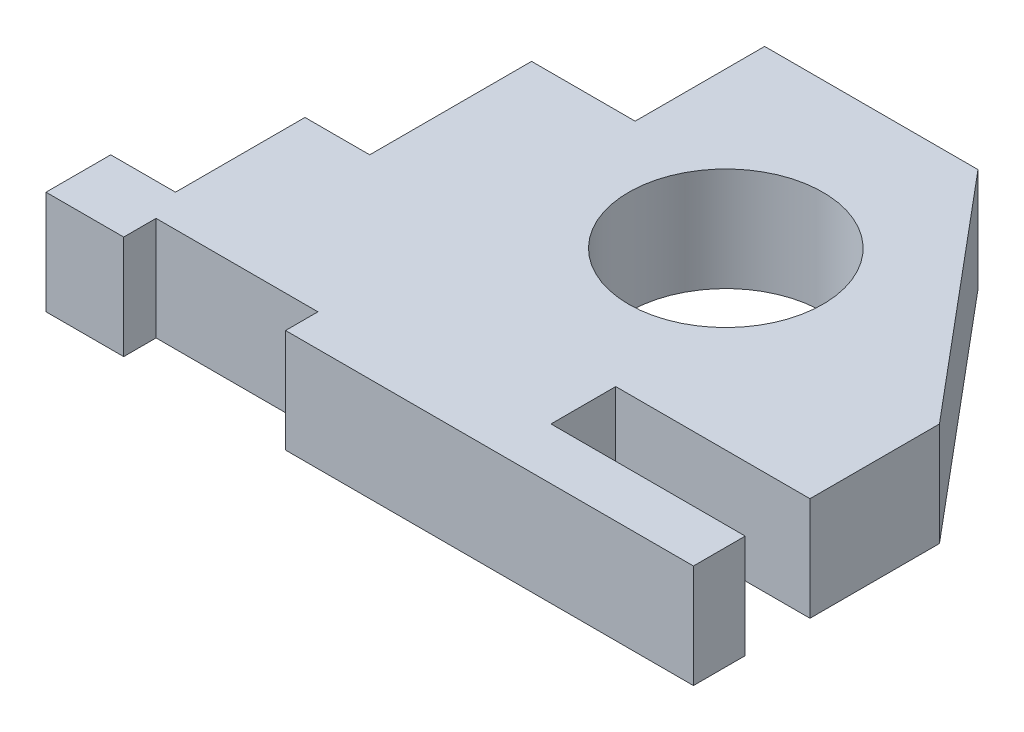
ISO-10303-21;
HEADER;
FILE_DESCRIPTION(('STEP AP214'),'2;1');
FILE_NAME('part.step','',(''),(''),'','','');
FILE_SCHEMA(('AUTOMOTIVE_DESIGN { 1 0 10303 214 1 1 1 1 }'));
ENDSEC;
DATA;
#1=APPLICATION_CONTEXT('core data for automotive mechanical design processes');
#2=APPLICATION_PROTOCOL_DEFINITION('international standard','automotive_design',2000,#1);
#3=PRODUCT_CONTEXT('',#1,'mechanical');
#4=PRODUCT('Part','Part','',(#3));
#5=PRODUCT_RELATED_PRODUCT_CATEGORY('part','',(#4));
#6=PRODUCT_DEFINITION_FORMATION('','',#4);
#7=PRODUCT_DEFINITION_CONTEXT('part definition',#1,'design');
#8=PRODUCT_DEFINITION('design','',#6,#7);
#9=PRODUCT_DEFINITION_SHAPE('','',#8);
#10=(LENGTH_UNIT() NAMED_UNIT(*) SI_UNIT(.MILLI.,.METRE.));
#11=(NAMED_UNIT(*) PLANE_ANGLE_UNIT() SI_UNIT($,.RADIAN.));
#12=(NAMED_UNIT(*) SI_UNIT($,.STERADIAN.) SOLID_ANGLE_UNIT());
#13=UNCERTAINTY_MEASURE_WITH_UNIT(LENGTH_MEASURE(1.E-05),#10,'distance_accuracy_value','');
#14=(GEOMETRIC_REPRESENTATION_CONTEXT(3) GLOBAL_UNCERTAINTY_ASSIGNED_CONTEXT((#13)) GLOBAL_UNIT_ASSIGNED_CONTEXT((#10,
#11,#12)) REPRESENTATION_CONTEXT('',''));
#15=CARTESIAN_POINT('',(0.,0.,0.));
#16=DIRECTION('',(0.,0.,1.));
#17=DIRECTION('',(1.,0.,0.));
#18=AXIS2_PLACEMENT_3D('',#15,#16,#17);
#19=CARTESIAN_POINT('',(0.,16.,0.));
#20=DIRECTION('',(0.,-1.,0.));
#21=DIRECTION('',(0.,0.,-1.));
#22=AXIS2_PLACEMENT_3D('',#19,#20,#21);
#23=PLANE('',#22);
#24=DIRECTION('',(0.,0.,1.));
#25=VECTOR('',#24,1.);
#26=CARTESIAN_POINT('',(0.,16.,0.));
#27=LINE('',#26,#25);
#28=CARTESIAN_POINT('',(0.,16.,-10.));
#29=VERTEX_POINT('',#28);
#30=CARTESIAN_POINT('',(0.,16.,0.));
#31=VERTEX_POINT('',#30);
#32=EDGE_CURVE('E233',#29,#31,#27,.T.);
#33=ORIENTED_EDGE('',*,*,#32,.T.);
#34=DIRECTION('',(1.,0.,0.));
#35=VECTOR('',#34,1.);
#36=CARTESIAN_POINT('',(0.,16.,0.));
#37=LINE('',#36,#35);
#38=CARTESIAN_POINT('',(12.,16.,0.));
#39=VERTEX_POINT('',#38);
#40=EDGE_CURVE('E126',#31,#39,#37,.T.);
#41=ORIENTED_EDGE('',*,*,#40,.T.);
#42=DIRECTION('',(0.,0.,-1.));
#43=VECTOR('',#42,1.);
#44=CARTESIAN_POINT('',(12.,16.,0.));
#45=LINE('',#44,#43);
#46=CARTESIAN_POINT('',(12.,16.,-5.));
#47=VERTEX_POINT('',#46);
#48=EDGE_CURVE('E281',#39,#47,#45,.T.);
#49=ORIENTED_EDGE('',*,*,#48,.T.);
#50=DIRECTION('',(1.,0.,0.));
#51=VECTOR('',#50,1.);
#52=CARTESIAN_POINT('',(12.,16.,-5.));
#53=LINE('',#52,#51);
#54=CARTESIAN_POINT('',(37.,16.,-5.));
#55=VERTEX_POINT('',#54);
#56=EDGE_CURVE('E300',#47,#55,#53,.T.);
#57=ORIENTED_EDGE('',*,*,#56,.T.);
#58=DIRECTION('',(0.,0.,1.));
#59=VECTOR('',#58,1.);
#60=CARTESIAN_POINT('',(37.,16.,-5.));
#61=LINE('',#60,#59);
#62=CARTESIAN_POINT('',(37.,16.,0.));
#63=VERTEX_POINT('',#62);
#64=EDGE_CURVE('E297',#55,#63,#61,.T.);
#65=ORIENTED_EDGE('',*,*,#64,.T.);
#66=DIRECTION('',(1.,0.,0.));
#67=VECTOR('',#66,1.);
#68=CARTESIAN_POINT('',(37.,16.,0.));
#69=LINE('',#68,#67);
#70=CARTESIAN_POINT('',(100.,16.,0.));
#71=VERTEX_POINT('',#70);
#72=EDGE_CURVE('E299',#63,#71,#69,.T.);
#73=ORIENTED_EDGE('',*,*,#72,.T.);
#74=DIRECTION('',(0.,0.,-1.));
#75=VECTOR('',#74,1.);
#76=CARTESIAN_POINT('',(100.,16.,0.));
#77=LINE('',#76,#75);
#78=CARTESIAN_POINT('',(100.,16.,-8.));
#79=VERTEX_POINT('',#78);
#80=EDGE_CURVE('E302',#71,#79,#77,.T.);
#81=ORIENTED_EDGE('',*,*,#80,.T.);
#82=DIRECTION('',(-1.,0.,0.));
#83=VECTOR('',#82,1.);
#84=CARTESIAN_POINT('',(100.,16.,-8.));
#85=LINE('',#84,#83);
#86=CARTESIAN_POINT('',(70.,16.,-8.));
#87=VERTEX_POINT('',#86);
#88=EDGE_CURVE('E308',#79,#87,#85,.T.);
#89=ORIENTED_EDGE('',*,*,#88,.T.);
#90=DIRECTION('',(0.,0.,-1.));
#91=VECTOR('',#90,1.);
#92=CARTESIAN_POINT('',(70.,16.,-8.));
#93=LINE('',#92,#91);
#94=CARTESIAN_POINT('',(70.,16.,-18.));
#95=VERTEX_POINT('',#94);
#96=EDGE_CURVE('E310',#87,#95,#93,.T.);
#97=ORIENTED_EDGE('',*,*,#96,.T.);
#98=DIRECTION('',(1.,0.,0.));
#99=VECTOR('',#98,1.);
#100=CARTESIAN_POINT('',(70.,16.,-18.));
#101=LINE('',#100,#99);
#102=CARTESIAN_POINT('',(100.,16.,-18.));
#103=VERTEX_POINT('',#102);
#104=EDGE_CURVE('E312',#95,#103,#101,.T.);
#105=ORIENTED_EDGE('',*,*,#104,.T.);
#106=DIRECTION('',(0.,0.,-1.));
#107=VECTOR('',#106,1.);
#108=CARTESIAN_POINT('',(100.,16.,-18.));
#109=LINE('',#108,#107);
#110=CARTESIAN_POINT('',(100.,16.,-38.));
#111=VERTEX_POINT('',#110);
#112=EDGE_CURVE('E314',#103,#111,#109,.T.);
#113=ORIENTED_EDGE('',*,*,#112,.T.);
#114=DIRECTION('',(-0.642787609686541,0.,-0.766044443118977));
#115=VECTOR('',#114,1.);
#116=CARTESIAN_POINT('',(100.,16.,-38.));
#117=LINE('',#116,#115);
#118=CARTESIAN_POINT('',(68.9533136464405,16.,-75.));
#119=VERTEX_POINT('',#118);
#120=EDGE_CURVE('E316',#111,#119,#117,.T.);
#121=ORIENTED_EDGE('',*,*,#120,.T.);
#122=DIRECTION('',(-1.,0.,0.));
#123=VECTOR('',#122,1.);
#124=CARTESIAN_POINT('',(68.9533136464405,16.,-75.));
#125=LINE('',#124,#123);
#126=CARTESIAN_POINT('',(36.,16.,-75.));
#127=VERTEX_POINT('',#126);
#128=EDGE_CURVE('E318',#119,#127,#125,.T.);
#129=ORIENTED_EDGE('',*,*,#128,.T.);
#130=DIRECTION('',(0.,0.,1.));
#131=VECTOR('',#130,1.);
#132=CARTESIAN_POINT('',(36.,16.,-75.));
#133=LINE('',#132,#131);
#134=CARTESIAN_POINT('',(36.,16.,-55.));
#135=VERTEX_POINT('',#134);
#136=EDGE_CURVE('E320',#127,#135,#133,.T.);
#137=ORIENTED_EDGE('',*,*,#136,.T.);
#138=DIRECTION('',(-1.,0.,0.));
#139=VECTOR('',#138,1.);
#140=CARTESIAN_POINT('',(36.,16.,-55.));
#141=LINE('',#140,#139);
#142=CARTESIAN_POINT('',(20.,16.,-55.));
#143=VERTEX_POINT('',#142);
#144=EDGE_CURVE('E322',#135,#143,#141,.T.);
#145=ORIENTED_EDGE('',*,*,#144,.T.);
#146=DIRECTION('',(0.,0.,1.));
#147=VECTOR('',#146,1.);
#148=CARTESIAN_POINT('',(20.,16.,-30.));
#149=LINE('',#148,#147);
#150=CARTESIAN_POINT('',(20.,16.,-30.));
#151=VERTEX_POINT('',#150);
#152=EDGE_CURVE('E178',#143,#151,#149,.T.);
#153=ORIENTED_EDGE('',*,*,#152,.T.);
#154=DIRECTION('',(-1.,0.,0.));
#155=VECTOR('',#154,1.);
#156=CARTESIAN_POINT('',(10.,16.,-30.));
#157=LINE('',#156,#155);
#158=CARTESIAN_POINT('',(10.,16.,-30.));
#159=VERTEX_POINT('',#158);
#160=EDGE_CURVE('E172',#151,#159,#157,.T.);
#161=ORIENTED_EDGE('',*,*,#160,.T.);
#162=DIRECTION('',(0.,0.,1.));
#163=VECTOR('',#162,1.);
#164=CARTESIAN_POINT('',(10.,16.,-10.));
#165=LINE('',#164,#163);
#166=CARTESIAN_POINT('',(10.,16.,-10.));
#167=VERTEX_POINT('',#166);
#168=EDGE_CURVE('E176',#159,#167,#165,.T.);
#169=ORIENTED_EDGE('',*,*,#168,.T.);
#170=DIRECTION('',(-1.,0.,0.));
#171=VECTOR('',#170,1.);
#172=CARTESIAN_POINT('',(0.,16.,-10.));
#173=LINE('',#172,#171);
#174=EDGE_CURVE('E50',#167,#29,#173,.T.);
#175=ORIENTED_EDGE('',*,*,#174,.T.);
#176=EDGE_LOOP('',(#33,#41,#49,#57,#65,#73,#81,#89,#97,#105,#113,#121,#129,#137,#145,#153,#161,
#169,#175));
#177=FACE_BOUND('',#176,.T.);
#178=CARTESIAN_POINT('',(60.,16.,-45.));
#179=DIRECTION('',(0.,1.,0.));
#180=DIRECTION('',(0.,0.,1.));
#181=AXIS2_PLACEMENT_3D('',#178,#179,#180);
#182=CIRCLE('',#181,15.);
#183=CARTESIAN_POINT('',(60.,16.,-30.));
#184=VERTEX_POINT('',#183);
#185=EDGE_CURVE('E200',#184,#184,#182,.T.);
#186=ORIENTED_EDGE('',*,*,#185,.F.);
#187=EDGE_LOOP('',(#186));
#188=FACE_BOUND('',#187,.T.);
#189=ADVANCED_FACE('F33',(#177,#188),#23,.F.);
#190=CARTESIAN_POINT('',(0.,0.,0.));
#191=DIRECTION('',(0.,-1.,0.));
#192=DIRECTION('',(0.,0.,-1.));
#193=AXIS2_PLACEMENT_3D('',#190,#191,#192);
#194=PLANE('',#193);
#195=DIRECTION('',(0.,0.,1.));
#196=VECTOR('',#195,1.);
#197=CARTESIAN_POINT('',(0.,0.,0.));
#198=LINE('',#197,#196);
#199=CARTESIAN_POINT('',(0.,0.,-10.));
#200=VERTEX_POINT('',#199);
#201=CARTESIAN_POINT('',(0.,0.,0.));
#202=VERTEX_POINT('',#201);
#203=EDGE_CURVE('E196',#200,#202,#198,.T.);
#204=ORIENTED_EDGE('',*,*,#203,.F.);
#205=DIRECTION('',(-1.,0.,0.));
#206=VECTOR('',#205,1.);
#207=CARTESIAN_POINT('',(0.,0.,-10.));
#208=LINE('',#207,#206);
#209=CARTESIAN_POINT('',(10.,0.,-10.));
#210=VERTEX_POINT('',#209);
#211=EDGE_CURVE('E118',#210,#200,#208,.T.);
#212=ORIENTED_EDGE('',*,*,#211,.F.);
#213=DIRECTION('',(0.,0.,1.));
#214=VECTOR('',#213,1.);
#215=CARTESIAN_POINT('',(10.,0.,-10.));
#216=LINE('',#215,#214);
#217=CARTESIAN_POINT('',(10.,0.,-30.));
#218=VERTEX_POINT('',#217);
#219=EDGE_CURVE('E112',#218,#210,#216,.T.);
#220=ORIENTED_EDGE('',*,*,#219,.F.);
#221=DIRECTION('',(-1.,0.,0.));
#222=VECTOR('',#221,1.);
#223=CARTESIAN_POINT('',(10.,0.,-30.));
#224=LINE('',#223,#222);
#225=CARTESIAN_POINT('',(20.,0.,-30.));
#226=VERTEX_POINT('',#225);
#227=EDGE_CURVE('E186',#226,#218,#224,.T.);
#228=ORIENTED_EDGE('',*,*,#227,.F.);
#229=DIRECTION('',(0.,0.,1.));
#230=VECTOR('',#229,1.);
#231=CARTESIAN_POINT('',(20.,0.,-30.));
#232=LINE('',#231,#230);
#233=CARTESIAN_POINT('',(20.,0.,-55.));
#234=VERTEX_POINT('',#233);
#235=EDGE_CURVE('E228',#234,#226,#232,.T.);
#236=ORIENTED_EDGE('',*,*,#235,.F.);
#237=DIRECTION('',(-1.,0.,0.));
#238=VECTOR('',#237,1.);
#239=CARTESIAN_POINT('',(36.,0.,-55.));
#240=LINE('',#239,#238);
#241=CARTESIAN_POINT('',(36.,0.,-55.));
#242=VERTEX_POINT('',#241);
#243=EDGE_CURVE('E226',#242,#234,#240,.T.);
#244=ORIENTED_EDGE('',*,*,#243,.F.);
#245=DIRECTION('',(0.,0.,1.));
#246=VECTOR('',#245,1.);
#247=CARTESIAN_POINT('',(36.,0.,-75.));
#248=LINE('',#247,#246);
#249=CARTESIAN_POINT('',(36.,0.,-75.));
#250=VERTEX_POINT('',#249);
#251=EDGE_CURVE('E224',#250,#242,#248,.T.);
#252=ORIENTED_EDGE('',*,*,#251,.F.);
#253=DIRECTION('',(-1.,0.,0.));
#254=VECTOR('',#253,1.);
#255=CARTESIAN_POINT('',(68.9533136464405,0.,-75.));
#256=LINE('',#255,#254);
#257=CARTESIAN_POINT('',(68.9533136464405,0.,-75.));
#258=VERTEX_POINT('',#257);
#259=EDGE_CURVE('E222',#258,#250,#256,.T.);
#260=ORIENTED_EDGE('',*,*,#259,.F.);
#261=DIRECTION('',(-0.642787609686541,0.,-0.766044443118977));
#262=VECTOR('',#261,1.);
#263=CARTESIAN_POINT('',(100.,0.,-38.));
#264=LINE('',#263,#262);
#265=CARTESIAN_POINT('',(100.,0.,-38.));
#266=VERTEX_POINT('',#265);
#267=EDGE_CURVE('E220',#266,#258,#264,.T.);
#268=ORIENTED_EDGE('',*,*,#267,.F.);
#269=DIRECTION('',(0.,0.,-1.));
#270=VECTOR('',#269,1.);
#271=CARTESIAN_POINT('',(100.,0.,-18.));
#272=LINE('',#271,#270);
#273=CARTESIAN_POINT('',(100.,0.,-18.));
#274=VERTEX_POINT('',#273);
#275=EDGE_CURVE('E218',#274,#266,#272,.T.);
#276=ORIENTED_EDGE('',*,*,#275,.F.);
#277=DIRECTION('',(1.,0.,0.));
#278=VECTOR('',#277,1.);
#279=CARTESIAN_POINT('',(70.,0.,-18.));
#280=LINE('',#279,#278);
#281=CARTESIAN_POINT('',(70.,0.,-18.));
#282=VERTEX_POINT('',#281);
#283=EDGE_CURVE('E216',#282,#274,#280,.T.);
#284=ORIENTED_EDGE('',*,*,#283,.F.);
#285=DIRECTION('',(0.,0.,-1.));
#286=VECTOR('',#285,1.);
#287=CARTESIAN_POINT('',(70.,0.,-8.));
#288=LINE('',#287,#286);
#289=CARTESIAN_POINT('',(70.,0.,-8.));
#290=VERTEX_POINT('',#289);
#291=EDGE_CURVE('E214',#290,#282,#288,.T.);
#292=ORIENTED_EDGE('',*,*,#291,.F.);
#293=DIRECTION('',(-1.,0.,0.));
#294=VECTOR('',#293,1.);
#295=CARTESIAN_POINT('',(100.,0.,-8.));
#296=LINE('',#295,#294);
#297=CARTESIAN_POINT('',(100.,0.,-8.));
#298=VERTEX_POINT('',#297);
#299=EDGE_CURVE('E212',#298,#290,#296,.T.);
#300=ORIENTED_EDGE('',*,*,#299,.F.);
#301=DIRECTION('',(0.,0.,-1.));
#302=VECTOR('',#301,1.);
#303=CARTESIAN_POINT('',(100.,0.,0.));
#304=LINE('',#303,#302);
#305=CARTESIAN_POINT('',(100.,0.,0.));
#306=VERTEX_POINT('',#305);
#307=EDGE_CURVE('E210',#306,#298,#304,.T.);
#308=ORIENTED_EDGE('',*,*,#307,.F.);
#309=DIRECTION('',(1.,0.,0.));
#310=VECTOR('',#309,1.);
#311=CARTESIAN_POINT('',(37.,0.,0.));
#312=LINE('',#311,#310);
#313=CARTESIAN_POINT('',(37.,0.,0.));
#314=VERTEX_POINT('',#313);
#315=EDGE_CURVE('E208',#314,#306,#312,.T.);
#316=ORIENTED_EDGE('',*,*,#315,.F.);
#317=DIRECTION('',(0.,0.,1.));
#318=VECTOR('',#317,1.);
#319=CARTESIAN_POINT('',(37.,0.,-5.));
#320=LINE('',#319,#318);
#321=CARTESIAN_POINT('',(37.,0.,-5.));
#322=VERTEX_POINT('',#321);
#323=EDGE_CURVE('E206',#322,#314,#320,.T.);
#324=ORIENTED_EDGE('',*,*,#323,.F.);
#325=DIRECTION('',(1.,0.,0.));
#326=VECTOR('',#325,1.);
#327=CARTESIAN_POINT('',(12.,0.,-5.));
#328=LINE('',#327,#326);
#329=CARTESIAN_POINT('',(12.,0.,-5.));
#330=VERTEX_POINT('',#329);
#331=EDGE_CURVE('E204',#330,#322,#328,.T.);
#332=ORIENTED_EDGE('',*,*,#331,.F.);
#333=DIRECTION('',(0.,0.,-1.));
#334=VECTOR('',#333,1.);
#335=CARTESIAN_POINT('',(12.,0.,0.));
#336=LINE('',#335,#334);
#337=CARTESIAN_POINT('',(12.,0.,0.));
#338=VERTEX_POINT('',#337);
#339=EDGE_CURVE('E202',#338,#330,#336,.T.);
#340=ORIENTED_EDGE('',*,*,#339,.F.);
#341=DIRECTION('',(1.,0.,0.));
#342=VECTOR('',#341,1.);
#343=CARTESIAN_POINT('',(0.,0.,0.));
#344=LINE('',#343,#342);
#345=EDGE_CURVE('E199',#202,#338,#344,.T.);
#346=ORIENTED_EDGE('',*,*,#345,.F.);
#347=EDGE_LOOP('',(#204,#212,#220,#228,#236,#244,#252,#260,#268,#276,#284,#292,#300,#308,#316,
#324,#332,#340,#346));
#348=FACE_BOUND('',#347,.T.);
#349=CARTESIAN_POINT('',(60.,0.,-45.));
#350=DIRECTION('',(0.,1.,0.));
#351=DIRECTION('',(0.,0.,1.));
#352=AXIS2_PLACEMENT_3D('',#349,#350,#351);
#353=CIRCLE('',#352,15.);
#354=CARTESIAN_POINT('',(60.,0.,-30.));
#355=VERTEX_POINT('',#354);
#356=EDGE_CURVE('E560',#355,#355,#353,.T.);
#357=ORIENTED_EDGE('',*,*,#356,.T.);
#358=EDGE_LOOP('',(#357));
#359=FACE_BOUND('',#358,.T.);
#360=ADVANCED_FACE('F285',(#348,#359),#194,.T.);
#361=CARTESIAN_POINT('',(0.,16.,0.));
#362=DIRECTION('',(1.,0.,0.));
#363=DIRECTION('',(0.,0.,-1.));
#364=AXIS2_PLACEMENT_3D('',#361,#362,#363);
#365=PLANE('',#364);
#366=ORIENTED_EDGE('',*,*,#203,.T.);
#367=DIRECTION('',(0.,-1.,0.));
#368=VECTOR('',#367,1.);
#369=CARTESIAN_POINT('',(0.,16.,0.));
#370=LINE('',#369,#368);
#371=EDGE_CURVE('E11',#31,#202,#370,.T.);
#372=ORIENTED_EDGE('',*,*,#371,.F.);
#373=ORIENTED_EDGE('',*,*,#32,.F.);
#374=DIRECTION('',(0.,-1.,0.));
#375=VECTOR('',#374,1.);
#376=CARTESIAN_POINT('',(0.,16.,-10.));
#377=LINE('',#376,#375);
#378=EDGE_CURVE('E192',#29,#200,#377,.T.);
#379=ORIENTED_EDGE('',*,*,#378,.T.);
#380=EDGE_LOOP('',(#366,#372,#373,#379));
#381=FACE_BOUND('',#380,.T.);
#382=ADVANCED_FACE('F35',(#381),#365,.F.);
#383=CARTESIAN_POINT('',(0.,16.,0.));
#384=DIRECTION('',(0.,0.,-1.));
#385=DIRECTION('',(-1.,0.,0.));
#386=AXIS2_PLACEMENT_3D('',#383,#384,#385);
#387=PLANE('',#386);
#388=ORIENTED_EDGE('',*,*,#345,.T.);
#389=DIRECTION('',(0.,-1.,0.));
#390=VECTOR('',#389,1.);
#391=CARTESIAN_POINT('',(12.,16.,0.));
#392=LINE('',#391,#390);
#393=EDGE_CURVE('E42',#39,#338,#392,.T.);
#394=ORIENTED_EDGE('',*,*,#393,.F.);
#395=ORIENTED_EDGE('',*,*,#40,.F.);
#396=ORIENTED_EDGE('',*,*,#371,.T.);
#397=EDGE_LOOP('',(#388,#394,#395,#396));
#398=FACE_BOUND('',#397,.T.);
#399=ADVANCED_FACE('F356',(#398),#387,.F.);
#400=CARTESIAN_POINT('',(12.,16.,0.));
#401=DIRECTION('',(-1.,0.,0.));
#402=DIRECTION('',(0.,0.,1.));
#403=AXIS2_PLACEMENT_3D('',#400,#401,#402);
#404=PLANE('',#403);
#405=ORIENTED_EDGE('',*,*,#339,.T.);
#406=DIRECTION('',(0.,-1.,0.));
#407=VECTOR('',#406,1.);
#408=CARTESIAN_POINT('',(12.,16.,-5.));
#409=LINE('',#408,#407);
#410=EDGE_CURVE('E273',#47,#330,#409,.T.);
#411=ORIENTED_EDGE('',*,*,#410,.F.);
#412=ORIENTED_EDGE('',*,*,#48,.F.);
#413=ORIENTED_EDGE('',*,*,#393,.T.);
#414=EDGE_LOOP('',(#405,#411,#412,#413));
#415=FACE_BOUND('',#414,.T.);
#416=ADVANCED_FACE('F279',(#415),#404,.F.);
#417=CARTESIAN_POINT('',(12.,16.,-5.));
#418=DIRECTION('',(0.,0.,-1.));
#419=DIRECTION('',(-1.,0.,0.));
#420=AXIS2_PLACEMENT_3D('',#417,#418,#419);
#421=PLANE('',#420);
#422=ORIENTED_EDGE('',*,*,#331,.T.);
#423=DIRECTION('',(0.,-1.,0.));
#424=VECTOR('',#423,1.);
#425=CARTESIAN_POINT('',(37.,16.,-5.));
#426=LINE('',#425,#424);
#427=EDGE_CURVE('E270',#55,#322,#426,.T.);
#428=ORIENTED_EDGE('',*,*,#427,.F.);
#429=ORIENTED_EDGE('',*,*,#56,.F.);
#430=ORIENTED_EDGE('',*,*,#410,.T.);
#431=EDGE_LOOP('',(#422,#428,#429,#430));
#432=FACE_BOUND('',#431,.T.);
#433=ADVANCED_FACE('F291',(#432),#421,.F.);
#434=CARTESIAN_POINT('',(37.,16.,-5.));
#435=DIRECTION('',(1.,0.,0.));
#436=DIRECTION('',(0.,0.,-1.));
#437=AXIS2_PLACEMENT_3D('',#434,#435,#436);
#438=PLANE('',#437);
#439=ORIENTED_EDGE('',*,*,#323,.T.);
#440=DIRECTION('',(0.,-1.,0.));
#441=VECTOR('',#440,1.);
#442=CARTESIAN_POINT('',(37.,16.,0.));
#443=LINE('',#442,#441);
#444=EDGE_CURVE('E267',#63,#314,#443,.T.);
#445=ORIENTED_EDGE('',*,*,#444,.F.);
#446=ORIENTED_EDGE('',*,*,#64,.F.);
#447=ORIENTED_EDGE('',*,*,#427,.T.);
#448=EDGE_LOOP('',(#439,#445,#446,#447));
#449=FACE_BOUND('',#448,.T.);
#450=ADVANCED_FACE('F295',(#449),#438,.F.);
#451=CARTESIAN_POINT('',(37.,16.,0.));
#452=DIRECTION('',(0.,0.,-1.));
#453=DIRECTION('',(-1.,0.,0.));
#454=AXIS2_PLACEMENT_3D('',#451,#452,#453);
#455=PLANE('',#454);
#456=ORIENTED_EDGE('',*,*,#315,.T.);
#457=DIRECTION('',(0.,-1.,0.));
#458=VECTOR('',#457,1.);
#459=CARTESIAN_POINT('',(100.,16.,0.));
#460=LINE('',#459,#458);
#461=EDGE_CURVE('E264',#71,#306,#460,.T.);
#462=ORIENTED_EDGE('',*,*,#461,.F.);
#463=ORIENTED_EDGE('',*,*,#72,.F.);
#464=ORIENTED_EDGE('',*,*,#444,.T.);
#465=EDGE_LOOP('',(#456,#462,#463,#464));
#466=FACE_BOUND('',#465,.T.);
#467=ADVANCED_FACE('F369',(#466),#455,.F.);
#468=CARTESIAN_POINT('',(100.,16.,0.));
#469=DIRECTION('',(-1.,0.,0.));
#470=DIRECTION('',(0.,0.,1.));
#471=AXIS2_PLACEMENT_3D('',#468,#469,#470);
#472=PLANE('',#471);
#473=ORIENTED_EDGE('',*,*,#307,.T.);
#474=DIRECTION('',(0.,-1.,0.));
#475=VECTOR('',#474,1.);
#476=CARTESIAN_POINT('',(100.,16.,-8.));
#477=LINE('',#476,#475);
#478=EDGE_CURVE('E261',#79,#298,#477,.T.);
#479=ORIENTED_EDGE('',*,*,#478,.F.);
#480=ORIENTED_EDGE('',*,*,#80,.F.);
#481=ORIENTED_EDGE('',*,*,#461,.T.);
#482=EDGE_LOOP('',(#473,#479,#480,#481));
#483=FACE_BOUND('',#482,.T.);
#484=ADVANCED_FACE('F372',(#483),#472,.F.);
#485=CARTESIAN_POINT('',(100.,16.,-8.));
#486=DIRECTION('',(0.,0.,1.));
#487=DIRECTION('',(1.,0.,0.));
#488=AXIS2_PLACEMENT_3D('',#485,#486,#487);
#489=PLANE('',#488);
#490=ORIENTED_EDGE('',*,*,#299,.T.);
#491=DIRECTION('',(0.,-1.,0.));
#492=VECTOR('',#491,1.);
#493=CARTESIAN_POINT('',(70.,16.,-8.));
#494=LINE('',#493,#492);
#495=EDGE_CURVE('E258',#87,#290,#494,.T.);
#496=ORIENTED_EDGE('',*,*,#495,.F.);
#497=ORIENTED_EDGE('',*,*,#88,.F.);
#498=ORIENTED_EDGE('',*,*,#478,.T.);
#499=EDGE_LOOP('',(#490,#496,#497,#498));
#500=FACE_BOUND('',#499,.T.);
#501=ADVANCED_FACE('F376',(#500),#489,.F.);
#502=CARTESIAN_POINT('',(70.,16.,-8.));
#503=DIRECTION('',(-1.,0.,0.));
#504=DIRECTION('',(0.,0.,1.));
#505=AXIS2_PLACEMENT_3D('',#502,#503,#504);
#506=PLANE('',#505);
#507=ORIENTED_EDGE('',*,*,#291,.T.);
#508=DIRECTION('',(0.,-1.,0.));
#509=VECTOR('',#508,1.);
#510=CARTESIAN_POINT('',(70.,16.,-18.));
#511=LINE('',#510,#509);
#512=EDGE_CURVE('E255',#95,#282,#511,.T.);
#513=ORIENTED_EDGE('',*,*,#512,.F.);
#514=ORIENTED_EDGE('',*,*,#96,.F.);
#515=ORIENTED_EDGE('',*,*,#495,.T.);
#516=EDGE_LOOP('',(#507,#513,#514,#515));
#517=FACE_BOUND('',#516,.T.);
#518=ADVANCED_FACE('F380',(#517),#506,.F.);
#519=CARTESIAN_POINT('',(70.,16.,-18.));
#520=DIRECTION('',(0.,0.,-1.));
#521=DIRECTION('',(-1.,0.,0.));
#522=AXIS2_PLACEMENT_3D('',#519,#520,#521);
#523=PLANE('',#522);
#524=ORIENTED_EDGE('',*,*,#283,.T.);
#525=DIRECTION('',(0.,-1.,0.));
#526=VECTOR('',#525,1.);
#527=CARTESIAN_POINT('',(100.,16.,-18.));
#528=LINE('',#527,#526);
#529=EDGE_CURVE('E252',#103,#274,#528,.T.);
#530=ORIENTED_EDGE('',*,*,#529,.F.);
#531=ORIENTED_EDGE('',*,*,#104,.F.);
#532=ORIENTED_EDGE('',*,*,#512,.T.);
#533=EDGE_LOOP('',(#524,#530,#531,#532));
#534=FACE_BOUND('',#533,.T.);
#535=ADVANCED_FACE('F384',(#534),#523,.F.);
#536=CARTESIAN_POINT('',(100.,16.,-18.));
#537=DIRECTION('',(-1.,0.,0.));
#538=DIRECTION('',(0.,0.,1.));
#539=AXIS2_PLACEMENT_3D('',#536,#537,#538);
#540=PLANE('',#539);
#541=ORIENTED_EDGE('',*,*,#275,.T.);
#542=DIRECTION('',(0.,-1.,0.));
#543=VECTOR('',#542,1.);
#544=CARTESIAN_POINT('',(100.,16.,-38.));
#545=LINE('',#544,#543);
#546=EDGE_CURVE('E249',#111,#266,#545,.T.);
#547=ORIENTED_EDGE('',*,*,#546,.F.);
#548=ORIENTED_EDGE('',*,*,#112,.F.);
#549=ORIENTED_EDGE('',*,*,#529,.T.);
#550=EDGE_LOOP('',(#541,#547,#548,#549));
#551=FACE_BOUND('',#550,.T.);
#552=ADVANCED_FACE('F388',(#551),#540,.F.);
#553=CARTESIAN_POINT('',(100.,16.,-38.));
#554=DIRECTION('',(-0.766044443118977,0.,0.642787609686541));
#555=DIRECTION('',(0.642787609686541,0.,0.766044443118977));
#556=AXIS2_PLACEMENT_3D('',#553,#554,#555);
#557=PLANE('',#556);
#558=ORIENTED_EDGE('',*,*,#267,.T.);
#559=DIRECTION('',(0.,-1.,0.));
#560=VECTOR('',#559,1.);
#561=CARTESIAN_POINT('',(68.9533136464405,16.,-75.));
#562=LINE('',#561,#560);
#563=EDGE_CURVE('E246',#119,#258,#562,.T.);
#564=ORIENTED_EDGE('',*,*,#563,.F.);
#565=ORIENTED_EDGE('',*,*,#120,.F.);
#566=ORIENTED_EDGE('',*,*,#546,.T.);
#567=EDGE_LOOP('',(#558,#564,#565,#566));
#568=FACE_BOUND('',#567,.T.);
#569=ADVANCED_FACE('F392',(#568),#557,.F.);
#570=CARTESIAN_POINT('',(68.9533136464405,16.,-75.));
#571=DIRECTION('',(0.,0.,1.));
#572=DIRECTION('',(1.,0.,0.));
#573=AXIS2_PLACEMENT_3D('',#570,#571,#572);
#574=PLANE('',#573);
#575=ORIENTED_EDGE('',*,*,#259,.T.);
#576=DIRECTION('',(0.,-1.,0.));
#577=VECTOR('',#576,1.);
#578=CARTESIAN_POINT('',(36.,16.,-75.));
#579=LINE('',#578,#577);
#580=EDGE_CURVE('E243',#127,#250,#579,.T.);
#581=ORIENTED_EDGE('',*,*,#580,.F.);
#582=ORIENTED_EDGE('',*,*,#128,.F.);
#583=ORIENTED_EDGE('',*,*,#563,.T.);
#584=EDGE_LOOP('',(#575,#581,#582,#583));
#585=FACE_BOUND('',#584,.T.);
#586=ADVANCED_FACE('F396',(#585),#574,.F.);
#587=CARTESIAN_POINT('',(36.,16.,-75.));
#588=DIRECTION('',(1.,0.,0.));
#589=DIRECTION('',(0.,0.,-1.));
#590=AXIS2_PLACEMENT_3D('',#587,#588,#589);
#591=PLANE('',#590);
#592=ORIENTED_EDGE('',*,*,#251,.T.);
#593=DIRECTION('',(0.,-1.,0.));
#594=VECTOR('',#593,1.);
#595=CARTESIAN_POINT('',(36.,16.,-55.));
#596=LINE('',#595,#594);
#597=EDGE_CURVE('E240',#135,#242,#596,.T.);
#598=ORIENTED_EDGE('',*,*,#597,.F.);
#599=ORIENTED_EDGE('',*,*,#136,.F.);
#600=ORIENTED_EDGE('',*,*,#580,.T.);
#601=EDGE_LOOP('',(#592,#598,#599,#600));
#602=FACE_BOUND('',#601,.T.);
#603=ADVANCED_FACE('F400',(#602),#591,.F.);
#604=CARTESIAN_POINT('',(36.,16.,-55.));
#605=DIRECTION('',(0.,0.,1.));
#606=DIRECTION('',(1.,0.,0.));
#607=AXIS2_PLACEMENT_3D('',#604,#605,#606);
#608=PLANE('',#607);
#609=ORIENTED_EDGE('',*,*,#243,.T.);
#610=DIRECTION('',(0.,-1.,0.));
#611=VECTOR('',#610,1.);
#612=CARTESIAN_POINT('',(20.,16.,-55.));
#613=LINE('',#612,#611);
#614=EDGE_CURVE('E237',#143,#234,#613,.T.);
#615=ORIENTED_EDGE('',*,*,#614,.F.);
#616=ORIENTED_EDGE('',*,*,#144,.F.);
#617=ORIENTED_EDGE('',*,*,#597,.T.);
#618=EDGE_LOOP('',(#609,#615,#616,#617));
#619=FACE_BOUND('',#618,.T.);
#620=ADVANCED_FACE('F328',(#619),#608,.F.);
#621=CARTESIAN_POINT('',(20.,16.,-30.));
#622=DIRECTION('',(1.,0.,0.));
#623=DIRECTION('',(0.,0.,-1.));
#624=AXIS2_PLACEMENT_3D('',#621,#622,#623);
#625=PLANE('',#624);
#626=ORIENTED_EDGE('',*,*,#235,.T.);
#627=DIRECTION('',(0.,-1.,0.));
#628=VECTOR('',#627,1.);
#629=CARTESIAN_POINT('',(20.,16.,-30.));
#630=LINE('',#629,#628);
#631=EDGE_CURVE('E187',#151,#226,#630,.T.);
#632=ORIENTED_EDGE('',*,*,#631,.F.);
#633=ORIENTED_EDGE('',*,*,#152,.F.);
#634=ORIENTED_EDGE('',*,*,#614,.T.);
#635=EDGE_LOOP('',(#626,#632,#633,#634));
#636=FACE_BOUND('',#635,.T.);
#637=ADVANCED_FACE('F332',(#636),#625,.F.);
#638=CARTESIAN_POINT('',(10.,16.,-30.));
#639=DIRECTION('',(0.,0.,1.));
#640=DIRECTION('',(1.,0.,0.));
#641=AXIS2_PLACEMENT_3D('',#638,#639,#640);
#642=PLANE('',#641);
#643=ORIENTED_EDGE('',*,*,#227,.T.);
#644=DIRECTION('',(0.,-1.,0.));
#645=VECTOR('',#644,1.);
#646=CARTESIAN_POINT('',(10.,16.,-30.));
#647=LINE('',#646,#645);
#648=EDGE_CURVE('E183',#159,#218,#647,.T.);
#649=ORIENTED_EDGE('',*,*,#648,.F.);
#650=ORIENTED_EDGE('',*,*,#160,.F.);
#651=ORIENTED_EDGE('',*,*,#631,.T.);
#652=EDGE_LOOP('',(#643,#649,#650,#651));
#653=FACE_BOUND('',#652,.T.);
#654=ADVANCED_FACE('F184',(#653),#642,.F.);
#655=CARTESIAN_POINT('',(10.,16.,-10.));
#656=DIRECTION('',(1.,0.,0.));
#657=DIRECTION('',(0.,0.,-1.));
#658=AXIS2_PLACEMENT_3D('',#655,#656,#657);
#659=PLANE('',#658);
#660=ORIENTED_EDGE('',*,*,#219,.T.);
#661=DIRECTION('',(0.,-1.,0.));
#662=VECTOR('',#661,1.);
#663=CARTESIAN_POINT('',(10.,16.,-10.));
#664=LINE('',#663,#662);
#665=EDGE_CURVE('E188',#167,#210,#664,.T.);
#666=ORIENTED_EDGE('',*,*,#665,.F.);
#667=ORIENTED_EDGE('',*,*,#168,.F.);
#668=ORIENTED_EDGE('',*,*,#648,.T.);
#669=EDGE_LOOP('',(#660,#666,#667,#668));
#670=FACE_BOUND('',#669,.T.);
#671=ADVANCED_FACE('F190',(#670),#659,.F.);
#672=CARTESIAN_POINT('',(0.,16.,-10.));
#673=DIRECTION('',(0.,0.,1.));
#674=DIRECTION('',(1.,0.,0.));
#675=AXIS2_PLACEMENT_3D('',#672,#673,#674);
#676=PLANE('',#675);
#677=ORIENTED_EDGE('',*,*,#211,.T.);
#678=ORIENTED_EDGE('',*,*,#378,.F.);
#679=ORIENTED_EDGE('',*,*,#174,.F.);
#680=ORIENTED_EDGE('',*,*,#665,.T.);
#681=EDGE_LOOP('',(#677,#678,#679,#680));
#682=FACE_BOUND('',#681,.T.);
#683=ADVANCED_FACE('F336',(#682),#676,.F.);
#684=CARTESIAN_POINT('',(60.,16.,-45.));
#685=DIRECTION('',(0.,-1.,0.));
#686=DIRECTION('',(0.,0.,-1.));
#687=AXIS2_PLACEMENT_3D('',#684,#685,#686);
#688=CYLINDRICAL_SURFACE('',#687,15.);
#689=ORIENTED_EDGE('',*,*,#185,.T.);
#690=EDGE_LOOP('',(#689));
#691=FACE_BOUND('',#690,.T.);
#692=ORIENTED_EDGE('',*,*,#356,.F.);
#693=EDGE_LOOP('',(#692));
#694=FACE_BOUND('',#693,.T.);
#695=ADVANCED_FACE('F338',(#691,#694),#688,.F.);
#696=CLOSED_SHELL('',(#189,#360,#382,#399,#416,#433,#450,#467,#484,#501,#518,#535,#552,#569,
#586,#603,#620,#637,#654,#671,#683,#695));
#697=MANIFOLD_SOLID_BREP('B2',#696);
#698=ADVANCED_BREP_SHAPE_REPRESENTATION('',(#18,#697),#14);
#699=SHAPE_DEFINITION_REPRESENTATION(#9,#698);
ENDSEC;
END-ISO-10303-21;
